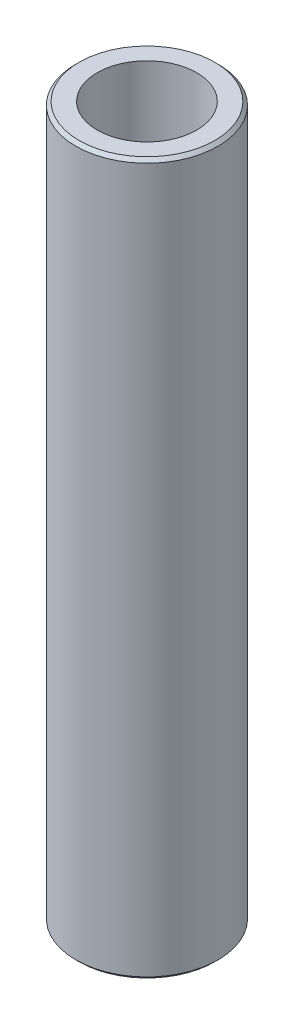
ISO-10303-21;
HEADER;
FILE_DESCRIPTION(('STEP AP214'),'2;1');
FILE_NAME('part.step','',(''),(''),'','','');
FILE_SCHEMA(('AUTOMOTIVE_DESIGN { 1 0 10303 214 1 1 1 1 }'));
ENDSEC;
DATA;
#1=APPLICATION_CONTEXT('core data for automotive mechanical design processes');
#2=APPLICATION_PROTOCOL_DEFINITION('international standard','automotive_design',2000,#1);
#3=PRODUCT_CONTEXT('',#1,'mechanical');
#4=PRODUCT('Part','Part','',(#3));
#5=PRODUCT_RELATED_PRODUCT_CATEGORY('part','',(#4));
#6=PRODUCT_DEFINITION_FORMATION('','',#4);
#7=PRODUCT_DEFINITION_CONTEXT('part definition',#1,'design');
#8=PRODUCT_DEFINITION('design','',#6,#7);
#9=PRODUCT_DEFINITION_SHAPE('','',#8);
#10=(LENGTH_UNIT() NAMED_UNIT(*) SI_UNIT(.MILLI.,.METRE.));
#11=(NAMED_UNIT(*) PLANE_ANGLE_UNIT() SI_UNIT($,.RADIAN.));
#12=(NAMED_UNIT(*) SI_UNIT($,.STERADIAN.) SOLID_ANGLE_UNIT());
#13=UNCERTAINTY_MEASURE_WITH_UNIT(LENGTH_MEASURE(1.E-05),#10,'distance_accuracy_value','');
#14=(GEOMETRIC_REPRESENTATION_CONTEXT(3) GLOBAL_UNCERTAINTY_ASSIGNED_CONTEXT((#13)) GLOBAL_UNIT_ASSIGNED_CONTEXT((#10,
#11,#12)) REPRESENTATION_CONTEXT('',''));
#15=CARTESIAN_POINT('',(0.,0.,0.));
#16=DIRECTION('',(0.,0.,1.));
#17=DIRECTION('',(1.,0.,0.));
#18=AXIS2_PLACEMENT_3D('',#15,#16,#17);
#19=CARTESIAN_POINT('',(0.,600.,0.));
#20=DIRECTION('',(0.,-1.,0.));
#21=DIRECTION('',(0.,0.,-1.));
#22=AXIS2_PLACEMENT_3D('',#19,#20,#21);
#23=CYLINDRICAL_SURFACE('',#22,60.);
#24=CARTESIAN_POINT('',(0.,597.222450633678,0.));
#25=DIRECTION('',(0.,1.,0.));
#26=DIRECTION('',(0.,0.,1.));
#27=AXIS2_PLACEMENT_3D('',#24,#25,#26);
#28=CIRCLE('',#27,60.);
#29=CARTESIAN_POINT('',(0.,597.222450633678,60.));
#30=VERTEX_POINT('',#29);
#31=EDGE_CURVE('E50',#30,#30,#28,.F.);
#32=ORIENTED_EDGE('',*,*,#31,.T.);
#33=EDGE_LOOP('',(#32));
#34=FACE_BOUND('',#33,.T.);
#35=CARTESIAN_POINT('',(0.,2.77754936632146,0.));
#36=DIRECTION('',(0.,1.,0.));
#37=DIRECTION('',(0.,0.,1.));
#38=AXIS2_PLACEMENT_3D('',#35,#36,#37);
#39=CIRCLE('',#38,60.);
#40=CARTESIAN_POINT('',(0.,2.77754936632146,60.));
#41=VERTEX_POINT('',#40);
#42=EDGE_CURVE('E51',#41,#41,#39,.T.);
#43=ORIENTED_EDGE('',*,*,#42,.T.);
#44=EDGE_LOOP('',(#43));
#45=FACE_BOUND('',#44,.T.);
#46=ADVANCED_FACE('F39',(#34,#45),#23,.T.);
#47=CARTESIAN_POINT('',(0.,600.,0.));
#48=DIRECTION('',(0.,1.,0.));
#49=DIRECTION('',(0.,0.,1.));
#50=AXIS2_PLACEMENT_3D('',#47,#48,#49);
#51=PLANE('',#50);
#52=CARTESIAN_POINT('',(0.,600.,0.));
#53=DIRECTION('',(0.,1.,0.));
#54=DIRECTION('',(0.,0.,1.));
#55=AXIS2_PLACEMENT_3D('',#52,#53,#54);
#56=CIRCLE('',#55,57.2224506336785);
#57=CARTESIAN_POINT('',(0.,600.,57.2224506336785));
#58=VERTEX_POINT('',#57);
#59=EDGE_CURVE('E54',#58,#58,#56,.T.);
#60=ORIENTED_EDGE('',*,*,#59,.T.);
#61=EDGE_LOOP('',(#60));
#62=FACE_BOUND('',#61,.T.);
#63=CARTESIAN_POINT('',(0.,600.,0.));
#64=DIRECTION('',(0.,1.,0.));
#65=DIRECTION('',(0.,0.,1.));
#66=AXIS2_PLACEMENT_3D('',#63,#64,#65);
#67=CIRCLE('',#66,41.9800125597983);
#68=CARTESIAN_POINT('',(0.,600.,41.9800125597983));
#69=VERTEX_POINT('',#68);
#70=EDGE_CURVE('E58',#69,#69,#67,.T.);
#71=ORIENTED_EDGE('',*,*,#70,.F.);
#72=EDGE_LOOP('',(#71));
#73=FACE_BOUND('',#72,.T.);
#74=ADVANCED_FACE('F69',(#62,#73),#51,.T.);
#75=CARTESIAN_POINT('',(0.,0.,0.));
#76=DIRECTION('',(0.,1.,0.));
#77=DIRECTION('',(0.,0.,1.));
#78=AXIS2_PLACEMENT_3D('',#75,#76,#77);
#79=PLANE('',#78);
#80=CARTESIAN_POINT('',(0.,0.,0.));
#81=DIRECTION('',(0.,1.,0.));
#82=DIRECTION('',(0.,0.,1.));
#83=AXIS2_PLACEMENT_3D('',#80,#81,#82);
#84=CIRCLE('',#83,57.2224506336785);
#85=CARTESIAN_POINT('',(0.,0.,57.2224506336785));
#86=VERTEX_POINT('',#85);
#87=EDGE_CURVE('E10',#86,#86,#84,.F.);
#88=ORIENTED_EDGE('',*,*,#87,.T.);
#89=EDGE_LOOP('',(#88));
#90=FACE_BOUND('',#89,.T.);
#91=CARTESIAN_POINT('',(0.,0.,0.));
#92=DIRECTION('',(0.,1.,0.));
#93=DIRECTION('',(0.,0.,1.));
#94=AXIS2_PLACEMENT_3D('',#91,#92,#93);
#95=CIRCLE('',#94,41.9800125597983);
#96=CARTESIAN_POINT('',(0.,0.,41.9800125597983));
#97=VERTEX_POINT('',#96);
#98=EDGE_CURVE('E63',#97,#97,#95,.T.);
#99=ORIENTED_EDGE('',*,*,#98,.T.);
#100=EDGE_LOOP('',(#99));
#101=FACE_BOUND('',#100,.T.);
#102=ADVANCED_FACE('F75',(#90,#101),#79,.F.);
#103=CARTESIAN_POINT('',(0.,600.,0.));
#104=DIRECTION('',(0.,-1.,0.));
#105=DIRECTION('',(0.,0.,-1.));
#106=AXIS2_PLACEMENT_3D('',#103,#104,#105);
#107=CYLINDRICAL_SURFACE('',#106,41.9800125597983);
#108=ORIENTED_EDGE('',*,*,#70,.T.);
#109=EDGE_LOOP('',(#108));
#110=FACE_BOUND('',#109,.T.);
#111=ORIENTED_EDGE('',*,*,#98,.F.);
#112=EDGE_LOOP('',(#111));
#113=FACE_BOUND('',#112,.T.);
#114=ADVANCED_FACE('F70',(#110,#113),#107,.F.);
#115=CARTESIAN_POINT('',(0.,600.,0.));
#116=DIRECTION('',(0.,-1.,0.));
#117=DIRECTION('',(0.,0.,-1.));
#118=AXIS2_PLACEMENT_3D('',#115,#116,#117);
#119=CONICAL_SURFACE('',#118,57.2224506336785,0.785398163397447);
#120=ORIENTED_EDGE('',*,*,#31,.F.);
#121=EDGE_LOOP('',(#120));
#122=FACE_BOUND('',#121,.T.);
#123=ORIENTED_EDGE('',*,*,#59,.F.);
#124=EDGE_LOOP('',(#123));
#125=FACE_BOUND('',#124,.T.);
#126=ADVANCED_FACE('F81',(#122,#125),#119,.T.);
#127=CARTESIAN_POINT('',(0.,2.77754936632146,0.));
#128=DIRECTION('',(0.,1.,0.));
#129=DIRECTION('',(0.,0.,1.));
#130=AXIS2_PLACEMENT_3D('',#127,#128,#129);
#131=CONICAL_SURFACE('',#130,60.,0.785398163397458);
#132=ORIENTED_EDGE('',*,*,#87,.F.);
#133=EDGE_LOOP('',(#132));
#134=FACE_BOUND('',#133,.T.);
#135=ORIENTED_EDGE('',*,*,#42,.F.);
#136=EDGE_LOOP('',(#135));
#137=FACE_BOUND('',#136,.T.);
#138=ADVANCED_FACE('F45',(#134,#137),#131,.T.);
#139=CLOSED_SHELL('',(#46,#74,#102,#114,#126,#138));
#140=MANIFOLD_SOLID_BREP('B2',#139);
#141=ADVANCED_BREP_SHAPE_REPRESENTATION('',(#18,#140),#14);
#142=SHAPE_DEFINITION_REPRESENTATION(#9,#141);
ENDSEC;
END-ISO-10303-21;
